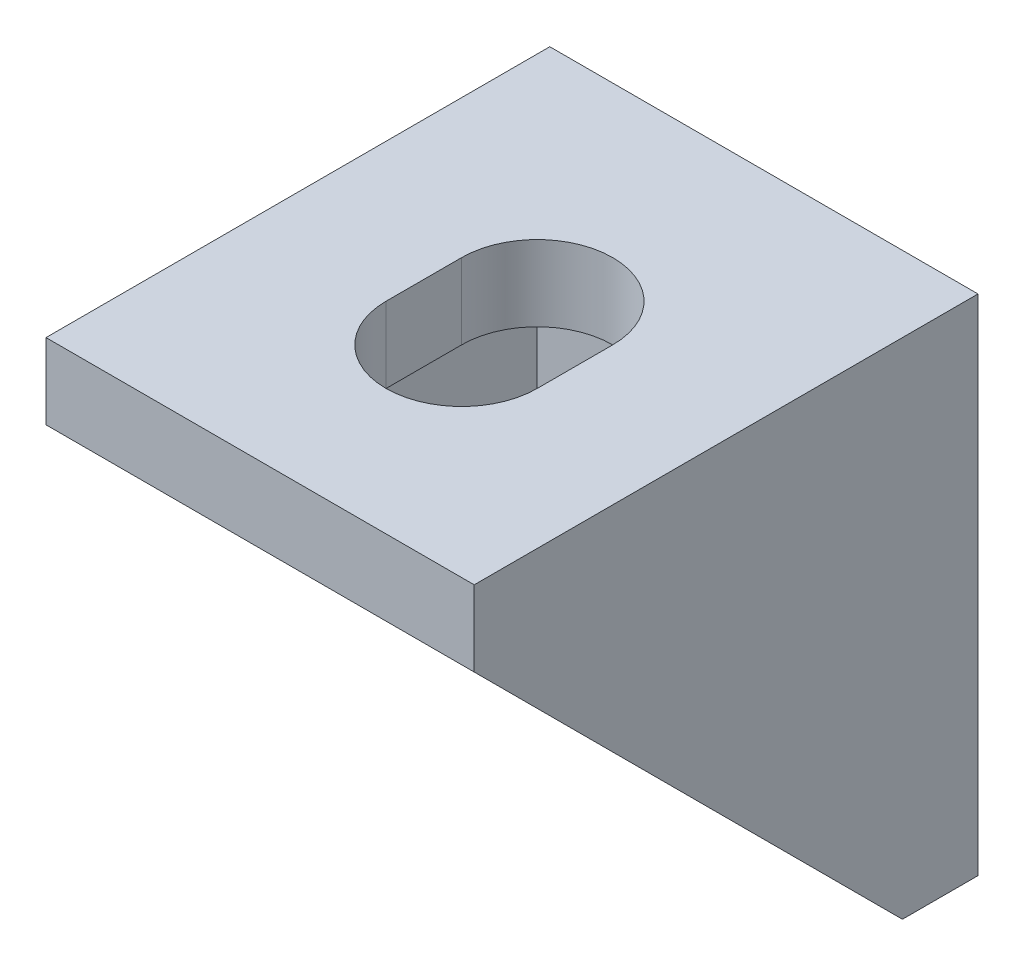
ISO-10303-21;
HEADER;
FILE_DESCRIPTION(('STEP AP214'),'2;1');
FILE_NAME('part.step','',(''),(''),'','','');
FILE_SCHEMA(('AUTOMOTIVE_DESIGN { 1 0 10303 214 1 1 1 1 }'));
ENDSEC;
DATA;
#1=APPLICATION_CONTEXT('core data for automotive mechanical design processes');
#2=APPLICATION_PROTOCOL_DEFINITION('international standard','automotive_design',2000,#1);
#3=PRODUCT_CONTEXT('',#1,'mechanical');
#4=PRODUCT('Part','Part','',(#3));
#5=PRODUCT_RELATED_PRODUCT_CATEGORY('part','',(#4));
#6=PRODUCT_DEFINITION_FORMATION('','',#4);
#7=PRODUCT_DEFINITION_CONTEXT('part definition',#1,'design');
#8=PRODUCT_DEFINITION('design','',#6,#7);
#9=PRODUCT_DEFINITION_SHAPE('','',#8);
#10=(LENGTH_UNIT() NAMED_UNIT(*) SI_UNIT(.MILLI.,.METRE.));
#11=(NAMED_UNIT(*) PLANE_ANGLE_UNIT() SI_UNIT($,.RADIAN.));
#12=(NAMED_UNIT(*) SI_UNIT($,.STERADIAN.) SOLID_ANGLE_UNIT());
#13=UNCERTAINTY_MEASURE_WITH_UNIT(LENGTH_MEASURE(1.E-05),#10,'distance_accuracy_value','');
#14=(GEOMETRIC_REPRESENTATION_CONTEXT(3) GLOBAL_UNCERTAINTY_ASSIGNED_CONTEXT((#13)) GLOBAL_UNIT_ASSIGNED_CONTEXT((#10,
#11,#12)) REPRESENTATION_CONTEXT('',''));
#15=CARTESIAN_POINT('',(0.,0.,0.));
#16=DIRECTION('',(0.,0.,1.));
#17=DIRECTION('',(1.,0.,0.));
#18=AXIS2_PLACEMENT_3D('',#15,#16,#17);
#19=CARTESIAN_POINT('',(8.5,0.,0.));
#20=DIRECTION('',(0.,-1.,0.));
#21=DIRECTION('',(0.,0.,-1.));
#22=AXIS2_PLACEMENT_3D('',#19,#20,#21);
#23=PLANE('',#22);
#24=DIRECTION('',(0.,0.,1.));
#25=VECTOR('',#24,1.);
#26=CARTESIAN_POINT('',(-8.5,0.,0.));
#27=LINE('',#26,#25);
#28=CARTESIAN_POINT('',(-8.5,0.,0.));
#29=VERTEX_POINT('',#28);
#30=CARTESIAN_POINT('',(-8.5,0.,20.));
#31=VERTEX_POINT('',#30);
#32=EDGE_CURVE('E246',#29,#31,#27,.T.);
#33=ORIENTED_EDGE('',*,*,#32,.T.);
#34=DIRECTION('',(-1.,0.,0.));
#35=VECTOR('',#34,1.);
#36=CARTESIAN_POINT('',(8.5,0.,20.));
#37=LINE('',#36,#35);
#38=CARTESIAN_POINT('',(8.5,0.,20.));
#39=VERTEX_POINT('',#38);
#40=EDGE_CURVE('E265',#39,#31,#37,.T.);
#41=ORIENTED_EDGE('',*,*,#40,.F.);
#42=DIRECTION('',(0.,0.,1.));
#43=VECTOR('',#42,1.);
#44=CARTESIAN_POINT('',(8.5,0.,0.));
#45=LINE('',#44,#43);
#46=CARTESIAN_POINT('',(8.5,0.,0.));
#47=VERTEX_POINT('',#46);
#48=EDGE_CURVE('E234',#47,#39,#45,.T.);
#49=ORIENTED_EDGE('',*,*,#48,.F.);
#50=DIRECTION('',(-1.,0.,0.));
#51=VECTOR('',#50,1.);
#52=CARTESIAN_POINT('',(8.5,0.,0.));
#53=LINE('',#52,#51);
#54=EDGE_CURVE('E268',#47,#29,#53,.T.);
#55=ORIENTED_EDGE('',*,*,#54,.T.);
#56=EDGE_LOOP('',(#33,#41,#49,#55));
#57=FACE_BOUND('',#56,.T.);
#58=CARTESIAN_POINT('',(0.,0.,9.00000000000001));
#59=DIRECTION('',(0.,-1.,0.));
#60=DIRECTION('',(0.,0.,-1.));
#61=AXIS2_PLACEMENT_3D('',#58,#59,#60);
#62=CIRCLE('',#61,3.);
#63=CARTESIAN_POINT('',(-3.,0.,9.));
#64=VERTEX_POINT('',#63);
#65=CARTESIAN_POINT('',(3.,0.,9.));
#66=VERTEX_POINT('',#65);
#67=EDGE_CURVE('E158',#64,#66,#62,.T.);
#68=ORIENTED_EDGE('',*,*,#67,.T.);
#69=DIRECTION('',(0.,0.,1.));
#70=VECTOR('',#69,1.);
#71=CARTESIAN_POINT('',(3.,0.,9.00000000000001));
#72=LINE('',#71,#70);
#73=CARTESIAN_POINT('',(3.,0.,12.));
#74=VERTEX_POINT('',#73);
#75=EDGE_CURVE('E147',#66,#74,#72,.T.);
#76=ORIENTED_EDGE('',*,*,#75,.T.);
#77=CARTESIAN_POINT('',(0.,0.,12.));
#78=DIRECTION('',(0.,-1.,0.));
#79=DIRECTION('',(0.,0.,-1.));
#80=AXIS2_PLACEMENT_3D('',#77,#78,#79);
#81=CIRCLE('',#80,3.);
#82=CARTESIAN_POINT('',(-3.,0.,12.));
#83=VERTEX_POINT('',#82);
#84=EDGE_CURVE('E167',#74,#83,#81,.T.);
#85=ORIENTED_EDGE('',*,*,#84,.T.);
#86=DIRECTION('',(0.,0.,-1.));
#87=VECTOR('',#86,1.);
#88=CARTESIAN_POINT('',(-3.,0.,9.00000000000001));
#89=LINE('',#88,#87);
#90=EDGE_CURVE('E163',#83,#64,#89,.T.);
#91=ORIENTED_EDGE('',*,*,#90,.T.);
#92=EDGE_LOOP('',(#68,#76,#85,#91));
#93=FACE_BOUND('',#92,.T.);
#94=ADVANCED_FACE('F35',(#57,#93),#23,.F.);
#95=CARTESIAN_POINT('',(-6.,-3.,2.99999999999999));
#96=DIRECTION('',(0.,1.,0.));
#97=DIRECTION('',(0.,0.,1.));
#98=AXIS2_PLACEMENT_3D('',#95,#96,#97);
#99=PLANE('',#98);
#100=DIRECTION('',(0.,0.,1.));
#101=VECTOR('',#100,1.);
#102=CARTESIAN_POINT('',(6.,-3.,2.99999999999999));
#103=LINE('',#102,#101);
#104=CARTESIAN_POINT('',(6.,-3.,2.99999999999999));
#105=VERTEX_POINT('',#104);
#106=CARTESIAN_POINT('',(6.,-3.,20.));
#107=VERTEX_POINT('',#106);
#108=EDGE_CURVE('E216',#105,#107,#103,.T.);
#109=ORIENTED_EDGE('',*,*,#108,.T.);
#110=DIRECTION('',(1.,0.,0.));
#111=VECTOR('',#110,1.);
#112=CARTESIAN_POINT('',(-6.,-3.,20.));
#113=LINE('',#112,#111);
#114=CARTESIAN_POINT('',(-6.,-3.,20.));
#115=VERTEX_POINT('',#114);
#116=EDGE_CURVE('E227',#115,#107,#113,.T.);
#117=ORIENTED_EDGE('',*,*,#116,.F.);
#118=DIRECTION('',(0.,0.,1.));
#119=VECTOR('',#118,1.);
#120=CARTESIAN_POINT('',(-6.,-3.,2.99999999999999));
#121=LINE('',#120,#119);
#122=CARTESIAN_POINT('',(-6.,-3.,2.99999999999999));
#123=VERTEX_POINT('',#122);
#124=EDGE_CURVE('E215',#123,#115,#121,.T.);
#125=ORIENTED_EDGE('',*,*,#124,.F.);
#126=DIRECTION('',(1.,0.,0.));
#127=VECTOR('',#126,1.);
#128=CARTESIAN_POINT('',(-6.,-3.,2.99999999999999));
#129=LINE('',#128,#127);
#130=EDGE_CURVE('E219',#123,#105,#129,.T.);
#131=ORIENTED_EDGE('',*,*,#130,.T.);
#132=EDGE_LOOP('',(#109,#117,#125,#131));
#133=FACE_BOUND('',#132,.T.);
#134=CARTESIAN_POINT('',(0.,-3.,9.));
#135=DIRECTION('',(0.,1.,0.));
#136=DIRECTION('',(-1.,0.,0.));
#137=AXIS2_PLACEMENT_3D('',#134,#135,#136);
#138=CIRCLE('',#137,3.);
#139=CARTESIAN_POINT('',(3.,-3.,9.));
#140=VERTEX_POINT('',#139);
#141=CARTESIAN_POINT('',(-3.,-3.,9.));
#142=VERTEX_POINT('',#141);
#143=EDGE_CURVE('E58',#140,#142,#138,.T.);
#144=ORIENTED_EDGE('',*,*,#143,.T.);
#145=DIRECTION('',(0.,0.,1.));
#146=VECTOR('',#145,1.);
#147=CARTESIAN_POINT('',(-3.,-3.,9.));
#148=LINE('',#147,#146);
#149=CARTESIAN_POINT('',(-3.,-3.,12.));
#150=VERTEX_POINT('',#149);
#151=EDGE_CURVE('E160',#142,#150,#148,.T.);
#152=ORIENTED_EDGE('',*,*,#151,.T.);
#153=CARTESIAN_POINT('',(0.,-3.,12.));
#154=DIRECTION('',(0.,1.,0.));
#155=DIRECTION('',(1.,0.,0.));
#156=AXIS2_PLACEMENT_3D('',#153,#154,#155);
#157=CIRCLE('',#156,3.);
#158=CARTESIAN_POINT('',(3.,-3.,12.));
#159=VERTEX_POINT('',#158);
#160=EDGE_CURVE('E172',#150,#159,#157,.T.);
#161=ORIENTED_EDGE('',*,*,#160,.T.);
#162=DIRECTION('',(0.,0.,-1.));
#163=VECTOR('',#162,1.);
#164=CARTESIAN_POINT('',(3.,-3.,9.));
#165=LINE('',#164,#163);
#166=EDGE_CURVE('E165',#159,#140,#165,.T.);
#167=ORIENTED_EDGE('',*,*,#166,.T.);
#168=EDGE_LOOP('',(#144,#152,#161,#167));
#169=FACE_BOUND('',#168,.T.);
#170=ADVANCED_FACE('F278',(#133,#169),#99,.F.);
#171=CARTESIAN_POINT('',(8.5,-20.,2.99999999999999));
#172=DIRECTION('',(0.,0.707106781186548,-0.707106781186547));
#173=DIRECTION('',(0.,0.707106781186547,0.707106781186548));
#174=AXIS2_PLACEMENT_3D('',#171,#172,#173);
#175=PLANE('',#174);
#176=DIRECTION('',(0.,0.707106781186547,0.707106781186548));
#177=VECTOR('',#176,1.);
#178=CARTESIAN_POINT('',(6.,-20.,2.99999999999999));
#179=LINE('',#178,#177);
#180=CARTESIAN_POINT('',(6.,-20.,2.99999999999999));
#181=VERTEX_POINT('',#180);
#182=EDGE_CURVE('E43',#181,#107,#179,.T.);
#183=ORIENTED_EDGE('',*,*,#182,.F.);
#184=DIRECTION('',(-1.,0.,0.));
#185=VECTOR('',#184,1.);
#186=CARTESIAN_POINT('',(8.5,-20.,2.99999999999999));
#187=LINE('',#186,#185);
#188=CARTESIAN_POINT('',(8.5,-20.,2.99999999999999));
#189=VERTEX_POINT('',#188);
#190=EDGE_CURVE('E258',#189,#181,#187,.T.);
#191=ORIENTED_EDGE('',*,*,#190,.F.);
#192=DIRECTION('',(0.,-0.707106781186548,-0.707106781186548));
#193=VECTOR('',#192,1.);
#194=CARTESIAN_POINT('',(8.5,-3.,20.));
#195=LINE('',#194,#193);
#196=CARTESIAN_POINT('',(8.5,-3.,20.));
#197=VERTEX_POINT('',#196);
#198=EDGE_CURVE('E239',#197,#189,#195,.T.);
#199=ORIENTED_EDGE('',*,*,#198,.F.);
#200=DIRECTION('',(-1.,0.,0.));
#201=VECTOR('',#200,1.);
#202=CARTESIAN_POINT('',(8.5,-3.,20.));
#203=LINE('',#202,#201);
#204=EDGE_CURVE('E262',#197,#107,#203,.T.);
#205=ORIENTED_EDGE('',*,*,#204,.T.);
#206=EDGE_LOOP('',(#183,#191,#199,#205));
#207=FACE_BOUND('',#206,.T.);
#208=ADVANCED_FACE('F287',(#207),#175,.F.);
#209=CARTESIAN_POINT('',(8.5,0.,0.));
#210=DIRECTION('',(0.,0.,1.));
#211=DIRECTION('',(0.,-1.,0.));
#212=AXIS2_PLACEMENT_3D('',#209,#210,#211);
#213=PLANE('',#212);
#214=DIRECTION('',(0.,-1.,0.));
#215=VECTOR('',#214,1.);
#216=CARTESIAN_POINT('',(3.,-9.00000000000001,0.));
#217=LINE('',#216,#215);
#218=CARTESIAN_POINT('',(3.,-9.00000000000001,0.));
#219=VERTEX_POINT('',#218);
#220=CARTESIAN_POINT('',(3.,-12.,0.));
#221=VERTEX_POINT('',#220);
#222=EDGE_CURVE('E182',#219,#221,#217,.T.);
#223=ORIENTED_EDGE('',*,*,#222,.F.);
#224=CARTESIAN_POINT('',(0.,-9.00000000000001,0.));
#225=DIRECTION('',(0.,0.,1.));
#226=DIRECTION('',(0.,-1.,0.));
#227=AXIS2_PLACEMENT_3D('',#224,#225,#226);
#228=CIRCLE('',#227,3.);
#229=CARTESIAN_POINT('',(-3.,-9.00000000000001,0.));
#230=VERTEX_POINT('',#229);
#231=EDGE_CURVE('E185',#230,#219,#228,.F.);
#232=ORIENTED_EDGE('',*,*,#231,.F.);
#233=DIRECTION('',(0.,1.,0.));
#234=VECTOR('',#233,1.);
#235=CARTESIAN_POINT('',(-3.,-9.00000000000001,0.));
#236=LINE('',#235,#234);
#237=CARTESIAN_POINT('',(-3.,-12.,0.));
#238=VERTEX_POINT('',#237);
#239=EDGE_CURVE('E202',#238,#230,#236,.T.);
#240=ORIENTED_EDGE('',*,*,#239,.F.);
#241=CARTESIAN_POINT('',(0.,-12.,0.));
#242=DIRECTION('',(0.,0.,1.));
#243=DIRECTION('',(0.,-1.,0.));
#244=AXIS2_PLACEMENT_3D('',#241,#242,#243);
#245=CIRCLE('',#244,3.);
#246=EDGE_CURVE('E154',#221,#238,#245,.F.);
#247=ORIENTED_EDGE('',*,*,#246,.F.);
#248=EDGE_LOOP('',(#223,#232,#240,#247));
#249=FACE_BOUND('',#248,.T.);
#250=DIRECTION('',(0.,1.,0.));
#251=VECTOR('',#250,1.);
#252=CARTESIAN_POINT('',(-8.5,0.,0.));
#253=LINE('',#252,#251);
#254=CARTESIAN_POINT('',(-8.5,-20.,0.));
#255=VERTEX_POINT('',#254);
#256=EDGE_CURVE('E226',#255,#29,#253,.T.);
#257=ORIENTED_EDGE('',*,*,#256,.T.);
#258=ORIENTED_EDGE('',*,*,#54,.F.);
#259=DIRECTION('',(0.,1.,0.));
#260=VECTOR('',#259,1.);
#261=CARTESIAN_POINT('',(8.5,0.,0.));
#262=LINE('',#261,#260);
#263=CARTESIAN_POINT('',(8.5,-20.,0.));
#264=VERTEX_POINT('',#263);
#265=EDGE_CURVE('E231',#264,#47,#262,.T.);
#266=ORIENTED_EDGE('',*,*,#265,.F.);
#267=DIRECTION('',(-1.,0.,0.));
#268=VECTOR('',#267,1.);
#269=CARTESIAN_POINT('',(8.5,-20.,0.));
#270=LINE('',#269,#268);
#271=EDGE_CURVE('E243',#264,#255,#270,.T.);
#272=ORIENTED_EDGE('',*,*,#271,.T.);
#273=EDGE_LOOP('',(#257,#258,#266,#272));
#274=FACE_BOUND('',#273,.T.);
#275=ADVANCED_FACE('F37',(#249,#274),#213,.F.);
#276=CARTESIAN_POINT('',(8.5,0.,20.));
#277=DIRECTION('',(0.,0.,-1.));
#278=DIRECTION('',(-1.,0.,0.));
#279=AXIS2_PLACEMENT_3D('',#276,#277,#278);
#280=PLANE('',#279);
#281=DIRECTION('',(0.,-1.,0.));
#282=VECTOR('',#281,1.);
#283=CARTESIAN_POINT('',(-8.5,0.,20.));
#284=LINE('',#283,#282);
#285=CARTESIAN_POINT('',(-8.5,-3.,20.));
#286=VERTEX_POINT('',#285);
#287=EDGE_CURVE('E248',#31,#286,#284,.T.);
#288=ORIENTED_EDGE('',*,*,#287,.T.);
#289=EDGE_CURVE('E261',#115,#286,#203,.T.);
#290=ORIENTED_EDGE('',*,*,#289,.F.);
#291=ORIENTED_EDGE('',*,*,#116,.T.);
#292=ORIENTED_EDGE('',*,*,#204,.F.);
#293=DIRECTION('',(0.,-1.,0.));
#294=VECTOR('',#293,1.);
#295=CARTESIAN_POINT('',(8.5,0.,20.));
#296=LINE('',#295,#294);
#297=EDGE_CURVE('E237',#39,#197,#296,.T.);
#298=ORIENTED_EDGE('',*,*,#297,.F.);
#299=ORIENTED_EDGE('',*,*,#40,.T.);
#300=EDGE_LOOP('',(#288,#290,#291,#292,#298,#299));
#301=FACE_BOUND('',#300,.T.);
#302=ADVANCED_FACE('F284',(#301),#280,.F.);
#303=CARTESIAN_POINT('',(-6.,-20.,2.99999999999999));
#304=VERTEX_POINT('',#303);
#305=CARTESIAN_POINT('',(-8.5,-20.,2.99999999999999));
#306=VERTEX_POINT('',#305);
#307=EDGE_CURVE('E257',#304,#306,#187,.T.);
#308=ORIENTED_EDGE('',*,*,#307,.F.);
#309=DIRECTION('',(0.,0.707106781186547,0.707106781186548));
#310=VECTOR('',#309,1.);
#311=CARTESIAN_POINT('',(-6.,-20.,2.99999999999999));
#312=LINE('',#311,#310);
#313=EDGE_CURVE('E11',#304,#115,#312,.T.);
#314=ORIENTED_EDGE('',*,*,#313,.T.);
#315=ORIENTED_EDGE('',*,*,#289,.T.);
#316=DIRECTION('',(0.,-0.707106781186547,-0.707106781186548));
#317=VECTOR('',#316,1.);
#318=CARTESIAN_POINT('',(-8.5,-20.,2.99999999999999));
#319=LINE('',#318,#317);
#320=EDGE_CURVE('E251',#286,#306,#319,.T.);
#321=ORIENTED_EDGE('',*,*,#320,.T.);
#322=EDGE_LOOP('',(#308,#314,#315,#321));
#323=FACE_BOUND('',#322,.T.);
#324=ADVANCED_FACE('F302',(#323),#175,.F.);
#325=CARTESIAN_POINT('',(8.5,-20.,0.));
#326=DIRECTION('',(0.,1.,0.));
#327=DIRECTION('',(0.,0.,1.));
#328=AXIS2_PLACEMENT_3D('',#325,#326,#327);
#329=PLANE('',#328);
#330=DIRECTION('',(0.,0.,-1.));
#331=VECTOR('',#330,1.);
#332=CARTESIAN_POINT('',(-8.5,-20.,0.));
#333=LINE('',#332,#331);
#334=EDGE_CURVE('E235',#306,#255,#333,.T.);
#335=ORIENTED_EDGE('',*,*,#334,.T.);
#336=ORIENTED_EDGE('',*,*,#271,.F.);
#337=DIRECTION('',(0.,0.,-1.));
#338=VECTOR('',#337,1.);
#339=CARTESIAN_POINT('',(8.5,-20.,0.));
#340=LINE('',#339,#338);
#341=EDGE_CURVE('E241',#189,#264,#340,.T.);
#342=ORIENTED_EDGE('',*,*,#341,.F.);
#343=ORIENTED_EDGE('',*,*,#190,.T.);
#344=DIRECTION('',(1.,0.,0.));
#345=VECTOR('',#344,1.);
#346=CARTESIAN_POINT('',(-6.,-20.,2.99999999999999));
#347=LINE('',#346,#345);
#348=EDGE_CURVE('E224',#304,#181,#347,.T.);
#349=ORIENTED_EDGE('',*,*,#348,.F.);
#350=ORIENTED_EDGE('',*,*,#307,.T.);
#351=EDGE_LOOP('',(#335,#336,#342,#343,#349,#350));
#352=FACE_BOUND('',#351,.T.);
#353=ADVANCED_FACE('F310',(#352),#329,.F.);
#354=CARTESIAN_POINT('',(8.5,0.,0.));
#355=DIRECTION('',(-1.,0.,0.));
#356=DIRECTION('',(0.,0.,1.));
#357=AXIS2_PLACEMENT_3D('',#354,#355,#356);
#358=PLANE('',#357);
#359=ORIENTED_EDGE('',*,*,#265,.T.);
#360=ORIENTED_EDGE('',*,*,#48,.T.);
#361=ORIENTED_EDGE('',*,*,#297,.T.);
#362=ORIENTED_EDGE('',*,*,#198,.T.);
#363=ORIENTED_EDGE('',*,*,#341,.T.);
#364=EDGE_LOOP('',(#359,#360,#361,#362,#363));
#365=FACE_BOUND('',#364,.T.);
#366=ADVANCED_FACE('F290',(#365),#358,.F.);
#367=CARTESIAN_POINT('',(-8.5,0.,0.));
#368=DIRECTION('',(-1.,0.,0.));
#369=DIRECTION('',(0.,0.,1.));
#370=AXIS2_PLACEMENT_3D('',#367,#368,#369);
#371=PLANE('',#370);
#372=ORIENTED_EDGE('',*,*,#256,.F.);
#373=ORIENTED_EDGE('',*,*,#334,.F.);
#374=ORIENTED_EDGE('',*,*,#320,.F.);
#375=ORIENTED_EDGE('',*,*,#287,.F.);
#376=ORIENTED_EDGE('',*,*,#32,.F.);
#377=EDGE_LOOP('',(#372,#373,#374,#375,#376));
#378=FACE_BOUND('',#377,.T.);
#379=ADVANCED_FACE('F298',(#378),#371,.T.);
#380=CARTESIAN_POINT('',(-6.,0.,0.));
#381=DIRECTION('',(-1.,0.,0.));
#382=DIRECTION('',(0.,0.,1.));
#383=AXIS2_PLACEMENT_3D('',#380,#381,#382);
#384=PLANE('',#383);
#385=DIRECTION('',(0.,1.,0.));
#386=VECTOR('',#385,1.);
#387=CARTESIAN_POINT('',(-6.,-3.,2.99999999999999));
#388=LINE('',#387,#386);
#389=EDGE_CURVE('E212',#304,#123,#388,.T.);
#390=ORIENTED_EDGE('',*,*,#389,.T.);
#391=ORIENTED_EDGE('',*,*,#124,.T.);
#392=ORIENTED_EDGE('',*,*,#313,.F.);
#393=EDGE_LOOP('',(#390,#391,#392));
#394=FACE_BOUND('',#393,.T.);
#395=ADVANCED_FACE('F306',(#394),#384,.F.);
#396=CARTESIAN_POINT('',(6.,0.,0.));
#397=DIRECTION('',(-1.,0.,0.));
#398=DIRECTION('',(0.,0.,1.));
#399=AXIS2_PLACEMENT_3D('',#396,#397,#398);
#400=PLANE('',#399);
#401=ORIENTED_EDGE('',*,*,#182,.T.);
#402=ORIENTED_EDGE('',*,*,#108,.F.);
#403=DIRECTION('',(0.,1.,0.));
#404=VECTOR('',#403,1.);
#405=CARTESIAN_POINT('',(6.,-3.,2.99999999999999));
#406=LINE('',#405,#404);
#407=EDGE_CURVE('E211',#181,#105,#406,.T.);
#408=ORIENTED_EDGE('',*,*,#407,.F.);
#409=EDGE_LOOP('',(#401,#402,#408));
#410=FACE_BOUND('',#409,.T.);
#411=ADVANCED_FACE('F274',(#410),#400,.T.);
#412=CARTESIAN_POINT('',(-6.,-3.,2.99999999999999));
#413=DIRECTION('',(0.,0.,-1.));
#414=DIRECTION('',(0.,1.,0.));
#415=AXIS2_PLACEMENT_3D('',#412,#413,#414);
#416=PLANE('',#415);
#417=DIRECTION('',(0.,-1.,0.));
#418=VECTOR('',#417,1.);
#419=CARTESIAN_POINT('',(-3.,-9.00000000000001,2.99999999999999));
#420=LINE('',#419,#418);
#421=CARTESIAN_POINT('',(-3.,-9.00000000000001,2.99999999999999));
#422=VERTEX_POINT('',#421);
#423=CARTESIAN_POINT('',(-3.,-12.,2.99999999999999));
#424=VERTEX_POINT('',#423);
#425=EDGE_CURVE('E190',#422,#424,#420,.T.);
#426=ORIENTED_EDGE('',*,*,#425,.F.);
#427=CARTESIAN_POINT('',(0.,-9.00000000000001,2.99999999999999));
#428=DIRECTION('',(0.,0.,1.));
#429=DIRECTION('',(-1.,0.,0.));
#430=AXIS2_PLACEMENT_3D('',#427,#428,#429);
#431=CIRCLE('',#430,3.);
#432=CARTESIAN_POINT('',(3.,-9.00000000000001,2.99999999999999));
#433=VERTEX_POINT('',#432);
#434=EDGE_CURVE('E188',#433,#422,#431,.T.);
#435=ORIENTED_EDGE('',*,*,#434,.F.);
#436=DIRECTION('',(0.,1.,0.));
#437=VECTOR('',#436,1.);
#438=CARTESIAN_POINT('',(3.,-9.00000000000001,2.99999999999999));
#439=LINE('',#438,#437);
#440=CARTESIAN_POINT('',(3.,-12.,2.99999999999999));
#441=VERTEX_POINT('',#440);
#442=EDGE_CURVE('E196',#441,#433,#439,.T.);
#443=ORIENTED_EDGE('',*,*,#442,.F.);
#444=CARTESIAN_POINT('',(0.,-12.,2.99999999999999));
#445=DIRECTION('',(0.,0.,1.));
#446=DIRECTION('',(1.,0.,0.));
#447=AXIS2_PLACEMENT_3D('',#444,#445,#446);
#448=CIRCLE('',#447,3.);
#449=EDGE_CURVE('E193',#424,#441,#448,.T.);
#450=ORIENTED_EDGE('',*,*,#449,.F.);
#451=EDGE_LOOP('',(#426,#435,#443,#450));
#452=FACE_BOUND('',#451,.T.);
#453=ORIENTED_EDGE('',*,*,#407,.T.);
#454=ORIENTED_EDGE('',*,*,#130,.F.);
#455=ORIENTED_EDGE('',*,*,#389,.F.);
#456=ORIENTED_EDGE('',*,*,#348,.T.);
#457=EDGE_LOOP('',(#453,#454,#455,#456));
#458=FACE_BOUND('',#457,.T.);
#459=ADVANCED_FACE('F308',(#452,#458),#416,.F.);
#460=CARTESIAN_POINT('',(0.,-9.00000000000001,-0.00100000000001401));
#461=DIRECTION('',(0.,0.,1.));
#462=DIRECTION('',(1.,0.,0.));
#463=AXIS2_PLACEMENT_3D('',#460,#461,#462);
#464=CYLINDRICAL_SURFACE('',#463,3.);
#465=ORIENTED_EDGE('',*,*,#231,.T.);
#466=DIRECTION('',(0.,0.,1.));
#467=VECTOR('',#466,1.);
#468=CARTESIAN_POINT('',(3.,-9.00000000000001,-0.00100000000001401));
#469=LINE('',#468,#467);
#470=EDGE_CURVE('E200',#219,#433,#469,.T.);
#471=ORIENTED_EDGE('',*,*,#470,.T.);
#472=ORIENTED_EDGE('',*,*,#434,.T.);
#473=DIRECTION('',(0.,0.,1.));
#474=VECTOR('',#473,1.);
#475=CARTESIAN_POINT('',(-3.,-9.00000000000001,-0.00100000000001401));
#476=LINE('',#475,#474);
#477=EDGE_CURVE('E199',#230,#422,#476,.T.);
#478=ORIENTED_EDGE('',*,*,#477,.F.);
#479=EDGE_LOOP('',(#465,#471,#472,#478));
#480=FACE_BOUND('',#479,.T.);
#481=ADVANCED_FACE('F331',(#480),#464,.F.);
#482=CARTESIAN_POINT('',(3.,-9.00000000000001,-0.00100000000001401));
#483=DIRECTION('',(1.,0.,0.));
#484=DIRECTION('',(0.,1.,0.));
#485=AXIS2_PLACEMENT_3D('',#482,#483,#484);
#486=PLANE('',#485);
#487=ORIENTED_EDGE('',*,*,#222,.T.);
#488=DIRECTION('',(0.,0.,1.));
#489=VECTOR('',#488,1.);
#490=CARTESIAN_POINT('',(3.,-12.,-0.00100000000001401));
#491=LINE('',#490,#489);
#492=EDGE_CURVE('E203',#221,#441,#491,.T.);
#493=ORIENTED_EDGE('',*,*,#492,.T.);
#494=ORIENTED_EDGE('',*,*,#442,.T.);
#495=ORIENTED_EDGE('',*,*,#470,.F.);
#496=EDGE_LOOP('',(#487,#493,#494,#495));
#497=FACE_BOUND('',#496,.T.);
#498=ADVANCED_FACE('F340',(#497),#486,.F.);
#499=CARTESIAN_POINT('',(0.,-12.,-0.00100000000001401));
#500=DIRECTION('',(0.,0.,1.));
#501=DIRECTION('',(1.,0.,0.));
#502=AXIS2_PLACEMENT_3D('',#499,#500,#501);
#503=CYLINDRICAL_SURFACE('',#502,3.);
#504=ORIENTED_EDGE('',*,*,#246,.T.);
#505=DIRECTION('',(0.,0.,1.));
#506=VECTOR('',#505,1.);
#507=CARTESIAN_POINT('',(-3.,-12.,-0.00100000000001401));
#508=LINE('',#507,#506);
#509=EDGE_CURVE('E205',#238,#424,#508,.T.);
#510=ORIENTED_EDGE('',*,*,#509,.T.);
#511=ORIENTED_EDGE('',*,*,#449,.T.);
#512=ORIENTED_EDGE('',*,*,#492,.F.);
#513=EDGE_LOOP('',(#504,#510,#511,#512));
#514=FACE_BOUND('',#513,.T.);
#515=ADVANCED_FACE('F345',(#514),#503,.F.);
#516=CARTESIAN_POINT('',(-3.,-9.00000000000001,-0.00100000000001401));
#517=DIRECTION('',(-1.,0.,0.));
#518=DIRECTION('',(0.,-1.,0.));
#519=AXIS2_PLACEMENT_3D('',#516,#517,#518);
#520=PLANE('',#519);
#521=ORIENTED_EDGE('',*,*,#239,.T.);
#522=ORIENTED_EDGE('',*,*,#477,.T.);
#523=ORIENTED_EDGE('',*,*,#425,.T.);
#524=ORIENTED_EDGE('',*,*,#509,.F.);
#525=EDGE_LOOP('',(#521,#522,#523,#524));
#526=FACE_BOUND('',#525,.T.);
#527=ADVANCED_FACE('F342',(#526),#520,.F.);
#528=CARTESIAN_POINT('',(0.,0.00100000000001488,9.00000000000001));
#529=DIRECTION('',(0.,-1.,0.));
#530=DIRECTION('',(0.,0.,-1.));
#531=AXIS2_PLACEMENT_3D('',#528,#529,#530);
#532=CYLINDRICAL_SURFACE('',#531,3.);
#533=DIRECTION('',(0.,-1.,0.));
#534=VECTOR('',#533,1.);
#535=CARTESIAN_POINT('',(-3.,0.00100000000001488,9.00000000000001));
#536=LINE('',#535,#534);
#537=EDGE_CURVE('E155',#64,#142,#536,.T.);
#538=ORIENTED_EDGE('',*,*,#537,.T.);
#539=ORIENTED_EDGE('',*,*,#143,.F.);
#540=DIRECTION('',(0.,-1.,0.));
#541=VECTOR('',#540,1.);
#542=CARTESIAN_POINT('',(3.,0.00100000000001488,9.00000000000001));
#543=LINE('',#542,#541);
#544=EDGE_CURVE('E149',#66,#140,#543,.T.);
#545=ORIENTED_EDGE('',*,*,#544,.F.);
#546=ORIENTED_EDGE('',*,*,#67,.F.);
#547=EDGE_LOOP('',(#538,#539,#545,#546));
#548=FACE_BOUND('',#547,.T.);
#549=ADVANCED_FACE('F157',(#548),#532,.F.);
#550=CARTESIAN_POINT('',(-3.,0.00100000000001488,9.00000000000001));
#551=DIRECTION('',(1.,0.,0.));
#552=DIRECTION('',(0.,0.,-1.));
#553=AXIS2_PLACEMENT_3D('',#550,#551,#552);
#554=PLANE('',#553);
#555=DIRECTION('',(0.,-1.,0.));
#556=VECTOR('',#555,1.);
#557=CARTESIAN_POINT('',(-3.,0.00100000000001141,12.));
#558=LINE('',#557,#556);
#559=EDGE_CURVE('E178',#83,#150,#558,.T.);
#560=ORIENTED_EDGE('',*,*,#559,.T.);
#561=ORIENTED_EDGE('',*,*,#151,.F.);
#562=ORIENTED_EDGE('',*,*,#537,.F.);
#563=ORIENTED_EDGE('',*,*,#90,.F.);
#564=EDGE_LOOP('',(#560,#561,#562,#563));
#565=FACE_BOUND('',#564,.T.);
#566=ADVANCED_FACE('F355',(#565),#554,.T.);
#567=CARTESIAN_POINT('',(0.,0.00100000000001141,12.));
#568=DIRECTION('',(0.,-1.,0.));
#569=DIRECTION('',(0.,0.,-1.));
#570=AXIS2_PLACEMENT_3D('',#567,#568,#569);
#571=CYLINDRICAL_SURFACE('',#570,3.);
#572=DIRECTION('',(0.,-1.,0.));
#573=VECTOR('',#572,1.);
#574=CARTESIAN_POINT('',(3.,0.00100000000001141,12.));
#575=LINE('',#574,#573);
#576=EDGE_CURVE('E50',#74,#159,#575,.T.);
#577=ORIENTED_EDGE('',*,*,#576,.T.);
#578=ORIENTED_EDGE('',*,*,#160,.F.);
#579=ORIENTED_EDGE('',*,*,#559,.F.);
#580=ORIENTED_EDGE('',*,*,#84,.F.);
#581=EDGE_LOOP('',(#577,#578,#579,#580));
#582=FACE_BOUND('',#581,.T.);
#583=ADVANCED_FACE('F358',(#582),#571,.F.);
#584=CARTESIAN_POINT('',(3.,0.00100000000001488,9.00000000000001));
#585=DIRECTION('',(-1.,0.,0.));
#586=DIRECTION('',(0.,0.,1.));
#587=AXIS2_PLACEMENT_3D('',#584,#585,#586);
#588=PLANE('',#587);
#589=ORIENTED_EDGE('',*,*,#544,.T.);
#590=ORIENTED_EDGE('',*,*,#166,.F.);
#591=ORIENTED_EDGE('',*,*,#576,.F.);
#592=ORIENTED_EDGE('',*,*,#75,.F.);
#593=EDGE_LOOP('',(#589,#590,#591,#592));
#594=FACE_BOUND('',#593,.T.);
#595=ADVANCED_FACE('F148',(#594),#588,.T.);
#596=CLOSED_SHELL('',(#94,#170,#208,#275,#302,#324,#353,#366,#379,#395,#411,#459,#481,#498,#515,
#527,#549,#566,#583,#595));
#597=MANIFOLD_SOLID_BREP('B2',#596);
#598=ADVANCED_BREP_SHAPE_REPRESENTATION('',(#18,#597),#14);
#599=SHAPE_DEFINITION_REPRESENTATION(#9,#598);
ENDSEC;
END-ISO-10303-21;
